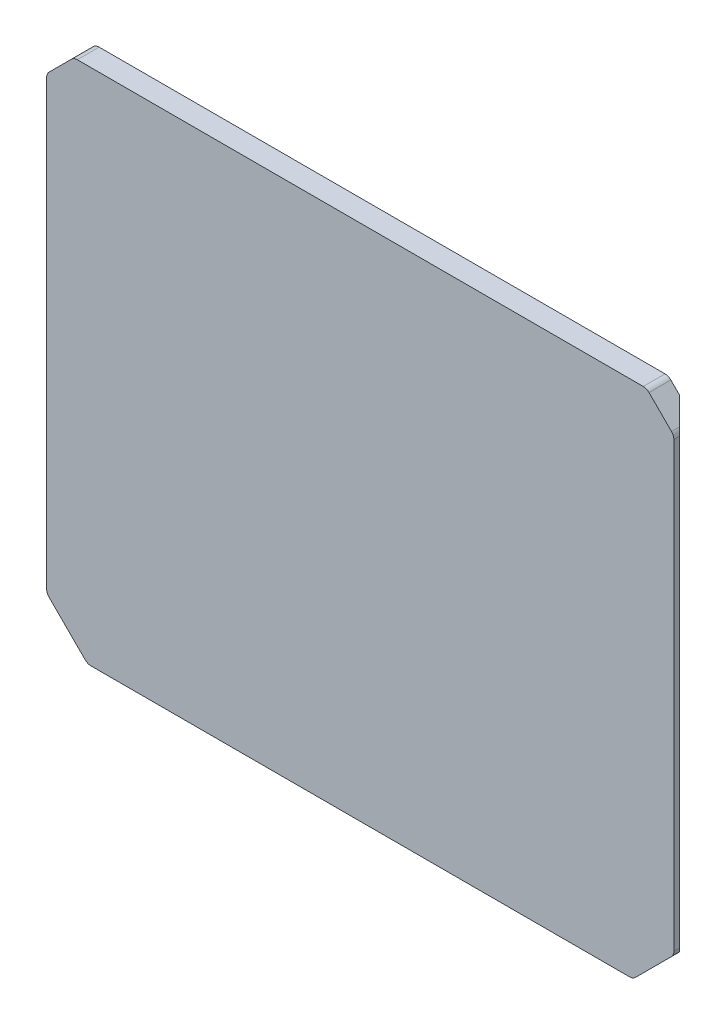
ISO-10303-21;
HEADER;
FILE_DESCRIPTION(('STEP AP214'),'2;1');
FILE_NAME('part.step','',(''),(''),'','','');
FILE_SCHEMA(('AUTOMOTIVE_DESIGN { 1 0 10303 214 1 1 1 1 }'));
ENDSEC;
DATA;
#1=APPLICATION_CONTEXT('core data for automotive mechanical design processes');
#2=APPLICATION_PROTOCOL_DEFINITION('international standard','automotive_design',2000,#1);
#3=PRODUCT_CONTEXT('',#1,'mechanical');
#4=PRODUCT('Part','Part','',(#3));
#5=PRODUCT_RELATED_PRODUCT_CATEGORY('part','',(#4));
#6=PRODUCT_DEFINITION_FORMATION('','',#4);
#7=PRODUCT_DEFINITION_CONTEXT('part definition',#1,'design');
#8=PRODUCT_DEFINITION('design','',#6,#7);
#9=PRODUCT_DEFINITION_SHAPE('','',#8);
#10=(LENGTH_UNIT() NAMED_UNIT(*) SI_UNIT(.MILLI.,.METRE.));
#11=(NAMED_UNIT(*) PLANE_ANGLE_UNIT() SI_UNIT($,.RADIAN.));
#12=(NAMED_UNIT(*) SI_UNIT($,.STERADIAN.) SOLID_ANGLE_UNIT());
#13=UNCERTAINTY_MEASURE_WITH_UNIT(LENGTH_MEASURE(1.E-05),#10,'distance_accuracy_value','');
#14=(GEOMETRIC_REPRESENTATION_CONTEXT(3) GLOBAL_UNCERTAINTY_ASSIGNED_CONTEXT((#13)) GLOBAL_UNIT_ASSIGNED_CONTEXT((#10,
#11,#12)) REPRESENTATION_CONTEXT('',''));
#15=CARTESIAN_POINT('',(0.,0.,0.));
#16=DIRECTION('',(0.,0.,1.));
#17=DIRECTION('',(1.,0.,0.));
#18=AXIS2_PLACEMENT_3D('',#15,#16,#17);
#19=CARTESIAN_POINT('',(-100.,0.,8.));
#20=DIRECTION('',(0.,1.,0.));
#21=DIRECTION('',(-1.,0.,0.));
#22=AXIS2_PLACEMENT_3D('',#19,#20,#21);
#23=PLANE('',#22);
#24=DIRECTION('',(1.,0.,0.));
#25=VECTOR('',#24,1.);
#26=CARTESIAN_POINT('',(-100.,0.,0.));
#27=LINE('',#26,#25);
#28=CARTESIAN_POINT('',(-98.7573593128807,0.,0.));
#29=VERTEX_POINT('',#28);
#30=CARTESIAN_POINT('',(98.7573593128807,0.,0.));
#31=VERTEX_POINT('',#30);
#32=EDGE_CURVE('E305',#29,#31,#27,.T.);
#33=ORIENTED_EDGE('',*,*,#32,.T.);
#34=DIRECTION('',(0.,0.,-1.));
#35=VECTOR('',#34,1.);
#36=CARTESIAN_POINT('',(98.7573593128807,0.,8.));
#37=LINE('',#36,#35);
#38=CARTESIAN_POINT('',(98.7573593128807,0.,8.));
#39=VERTEX_POINT('',#38);
#40=EDGE_CURVE('E264',#31,#39,#37,.F.);
#41=ORIENTED_EDGE('',*,*,#40,.T.);
#42=DIRECTION('',(1.,0.,0.));
#43=VECTOR('',#42,1.);
#44=CARTESIAN_POINT('',(-100.,0.,8.));
#45=LINE('',#44,#43);
#46=CARTESIAN_POINT('',(-98.7573593128807,0.,8.));
#47=VERTEX_POINT('',#46);
#48=EDGE_CURVE('E286',#47,#39,#45,.T.);
#49=ORIENTED_EDGE('',*,*,#48,.F.);
#50=DIRECTION('',(0.,0.,-1.));
#51=VECTOR('',#50,1.);
#52=CARTESIAN_POINT('',(-98.7573593128807,0.,8.));
#53=LINE('',#52,#51);
#54=EDGE_CURVE('E261',#47,#29,#53,.T.);
#55=ORIENTED_EDGE('',*,*,#54,.T.);
#56=EDGE_LOOP('',(#33,#41,#49,#55));
#57=FACE_BOUND('',#56,.T.);
#58=ADVANCED_FACE('F39',(#57),#23,.F.);
#59=CARTESIAN_POINT('',(100.,0.,8.));
#60=DIRECTION('',(-0.707106781186548,0.707106781186547,0.));
#61=DIRECTION('',(-0.707106781186547,-0.707106781186548,0.));
#62=AXIS2_PLACEMENT_3D('',#59,#60,#61);
#63=PLANE('',#62);
#64=DIRECTION('',(-0.577350269189626,-0.577350269189627,-0.577350269189624));
#65=VECTOR('',#64,1.);
#66=CARTESIAN_POINT('',(115.,15.,6.));
#67=LINE('',#66,#65);
#68=CARTESIAN_POINT('',(109.,8.99999999999998,0.));
#69=VERTEX_POINT('',#68);
#70=CARTESIAN_POINT('',(114.12132034356,14.1213203435596,5.12132034355965));
#71=VERTEX_POINT('',#70);
#72=EDGE_CURVE('E191',#69,#71,#67,.F.);
#73=ORIENTED_EDGE('',*,*,#72,.T.);
#74=DIRECTION('',(0.,0.,-1.));
#75=VECTOR('',#74,1.);
#76=CARTESIAN_POINT('',(114.12132034356,14.1213203435596,8.));
#77=LINE('',#76,#75);
#78=CARTESIAN_POINT('',(114.12132034356,14.1213203435596,8.));
#79=VERTEX_POINT('',#78);
#80=EDGE_CURVE('E259',#71,#79,#77,.F.);
#81=ORIENTED_EDGE('',*,*,#80,.T.);
#82=DIRECTION('',(0.707106781186547,0.707106781186548,0.));
#83=VECTOR('',#82,1.);
#84=CARTESIAN_POINT('',(100.,0.,8.));
#85=LINE('',#84,#83);
#86=CARTESIAN_POINT('',(100.87867965644,0.878679656440342,8.));
#87=VERTEX_POINT('',#86);
#88=EDGE_CURVE('E289',#87,#79,#85,.T.);
#89=ORIENTED_EDGE('',*,*,#88,.F.);
#90=DIRECTION('',(0.,0.,-1.));
#91=VECTOR('',#90,1.);
#92=CARTESIAN_POINT('',(100.87867965644,0.878679656440342,8.));
#93=LINE('',#92,#91);
#94=CARTESIAN_POINT('',(100.87867965644,0.878679656440342,0.));
#95=VERTEX_POINT('',#94);
#96=EDGE_CURVE('E256',#87,#95,#93,.T.);
#97=ORIENTED_EDGE('',*,*,#96,.T.);
#98=DIRECTION('',(0.707106781186547,0.707106781186548,0.));
#99=VECTOR('',#98,1.);
#100=CARTESIAN_POINT('',(100.,0.,0.));
#101=LINE('',#100,#99);
#102=EDGE_CURVE('E187',#95,#69,#101,.T.);
#103=ORIENTED_EDGE('',*,*,#102,.T.);
#104=EDGE_LOOP('',(#73,#81,#89,#97,#103));
#105=FACE_BOUND('',#104,.T.);
#106=ADVANCED_FACE('F344',(#105),#63,.F.);
#107=CARTESIAN_POINT('',(115.,15.,8.));
#108=DIRECTION('',(-1.,0.,0.));
#109=DIRECTION('',(0.,-1.,0.));
#110=AXIS2_PLACEMENT_3D('',#107,#108,#109);
#111=PLANE('',#110);
#112=DIRECTION('',(0.,1.,0.));
#113=VECTOR('',#112,1.);
#114=CARTESIAN_POINT('',(115.,15.,6.));
#115=LINE('',#114,#113);
#116=CARTESIAN_POINT('',(115.,16.2426406871193,6.));
#117=VERTEX_POINT('',#116);
#118=CARTESIAN_POINT('',(115.,178.757359312881,6.));
#119=VERTEX_POINT('',#118);
#120=EDGE_CURVE('E175',#117,#119,#115,.T.);
#121=ORIENTED_EDGE('',*,*,#120,.T.);
#122=DIRECTION('',(0.,0.,-1.));
#123=VECTOR('',#122,1.);
#124=CARTESIAN_POINT('',(115.,178.757359312881,8.));
#125=LINE('',#124,#123);
#126=CARTESIAN_POINT('',(115.,178.757359312881,8.));
#127=VERTEX_POINT('',#126);
#128=EDGE_CURVE('E254',#119,#127,#125,.F.);
#129=ORIENTED_EDGE('',*,*,#128,.T.);
#130=DIRECTION('',(0.,1.,0.));
#131=VECTOR('',#130,1.);
#132=CARTESIAN_POINT('',(115.,15.,8.));
#133=LINE('',#132,#131);
#134=CARTESIAN_POINT('',(115.,16.2426406871193,8.));
#135=VERTEX_POINT('',#134);
#136=EDGE_CURVE('E332',#135,#127,#133,.T.);
#137=ORIENTED_EDGE('',*,*,#136,.F.);
#138=DIRECTION('',(0.,0.,-1.));
#139=VECTOR('',#138,1.);
#140=CARTESIAN_POINT('',(115.,16.2426406871193,8.));
#141=LINE('',#140,#139);
#142=EDGE_CURVE('E252',#135,#117,#141,.T.);
#143=ORIENTED_EDGE('',*,*,#142,.T.);
#144=EDGE_LOOP('',(#121,#129,#137,#143));
#145=FACE_BOUND('',#144,.T.);
#146=ADVANCED_FACE('F343',(#145),#111,.F.);
#147=CARTESIAN_POINT('',(105.,190.,8.));
#148=DIRECTION('',(-0.707106781186547,-0.707106781186547,0.));
#149=DIRECTION('',(0.707106781186548,-0.707106781186548,0.));
#150=AXIS2_PLACEMENT_3D('',#147,#148,#149);
#151=PLANE('',#150);
#152=DIRECTION('',(-0.707106781186547,0.707106781186547,0.));
#153=VECTOR('',#152,1.);
#154=CARTESIAN_POINT('',(105.,190.,8.));
#155=LINE('',#154,#153);
#156=CARTESIAN_POINT('',(114.12132034356,180.87867965644,8.));
#157=VERTEX_POINT('',#156);
#158=CARTESIAN_POINT('',(105.87867965644,189.12132034356,8.));
#159=VERTEX_POINT('',#158);
#160=EDGE_CURVE('E327',#157,#159,#155,.T.);
#161=ORIENTED_EDGE('',*,*,#160,.F.);
#162=DIRECTION('',(0.,0.,-1.));
#163=VECTOR('',#162,1.);
#164=CARTESIAN_POINT('',(114.12132034356,180.87867965644,8.));
#165=LINE('',#164,#163);
#166=CARTESIAN_POINT('',(114.12132034356,180.87867965644,5.1213203435596));
#167=VERTEX_POINT('',#166);
#168=EDGE_CURVE('E172',#157,#167,#165,.T.);
#169=ORIENTED_EDGE('',*,*,#168,.T.);
#170=DIRECTION('',(0.577350269189626,-0.577350269189626,0.577350269189625));
#171=VECTOR('',#170,1.);
#172=CARTESIAN_POINT('',(170.,125.,60.9999999999999));
#173=LINE('',#172,#171);
#174=CARTESIAN_POINT('',(109.,186.,0.));
#175=VERTEX_POINT('',#174);
#176=EDGE_CURVE('E165',#167,#175,#173,.F.);
#177=ORIENTED_EDGE('',*,*,#176,.T.);
#178=DIRECTION('',(-0.707106781186547,0.707106781186547,0.));
#179=VECTOR('',#178,1.);
#180=CARTESIAN_POINT('',(105.,190.,0.));
#181=LINE('',#180,#179);
#182=CARTESIAN_POINT('',(105.87867965644,189.12132034356,0.));
#183=VERTEX_POINT('',#182);
#184=EDGE_CURVE('E169',#175,#183,#181,.T.);
#185=ORIENTED_EDGE('',*,*,#184,.T.);
#186=DIRECTION('',(0.,0.,-1.));
#187=VECTOR('',#186,1.);
#188=CARTESIAN_POINT('',(105.87867965644,189.12132034356,8.));
#189=LINE('',#188,#187);
#190=EDGE_CURVE('E247',#183,#159,#189,.F.);
#191=ORIENTED_EDGE('',*,*,#190,.T.);
#192=EDGE_LOOP('',(#161,#169,#177,#185,#191));
#193=FACE_BOUND('',#192,.T.);
#194=ADVANCED_FACE('F168',(#193),#151,.F.);
#195=CARTESIAN_POINT('',(-105.,190.,8.));
#196=DIRECTION('',(0.,-1.,0.));
#197=DIRECTION('',(0.,0.,-1.));
#198=AXIS2_PLACEMENT_3D('',#195,#196,#197);
#199=PLANE('',#198);
#200=DIRECTION('',(-1.,0.,0.));
#201=VECTOR('',#200,1.);
#202=CARTESIAN_POINT('',(-105.,190.,0.));
#203=LINE('',#202,#201);
#204=CARTESIAN_POINT('',(103.757359312881,190.,0.));
#205=VERTEX_POINT('',#204);
#206=CARTESIAN_POINT('',(-103.757359312881,190.,0.));
#207=VERTEX_POINT('',#206);
#208=EDGE_CURVE('E186',#205,#207,#203,.T.);
#209=ORIENTED_EDGE('',*,*,#208,.T.);
#210=DIRECTION('',(0.,0.,-1.));
#211=VECTOR('',#210,1.);
#212=CARTESIAN_POINT('',(-103.757359312881,190.,8.));
#213=LINE('',#212,#211);
#214=CARTESIAN_POINT('',(-103.757359312881,190.,8.));
#215=VERTEX_POINT('',#214);
#216=EDGE_CURVE('E220',#207,#215,#213,.F.);
#217=ORIENTED_EDGE('',*,*,#216,.T.);
#218=DIRECTION('',(-1.,0.,0.));
#219=VECTOR('',#218,1.);
#220=CARTESIAN_POINT('',(-105.,190.,8.));
#221=LINE('',#220,#219);
#222=CARTESIAN_POINT('',(103.757359312881,190.,8.));
#223=VERTEX_POINT('',#222);
#224=EDGE_CURVE('E323',#223,#215,#221,.T.);
#225=ORIENTED_EDGE('',*,*,#224,.F.);
#226=DIRECTION('',(0.,0.,-1.));
#227=VECTOR('',#226,1.);
#228=CARTESIAN_POINT('',(103.757359312881,190.,8.));
#229=LINE('',#228,#227);
#230=EDGE_CURVE('E217',#223,#205,#229,.T.);
#231=ORIENTED_EDGE('',*,*,#230,.T.);
#232=EDGE_LOOP('',(#209,#217,#225,#231));
#233=FACE_BOUND('',#232,.T.);
#234=ADVANCED_FACE('F311',(#233),#199,.F.);
#235=CARTESIAN_POINT('',(-115.,180.,8.));
#236=DIRECTION('',(0.707106781186549,-0.707106781186546,0.));
#237=DIRECTION('',(0.707106781186546,0.707106781186549,0.));
#238=AXIS2_PLACEMENT_3D('',#235,#236,#237);
#239=PLANE('',#238);
#240=DIRECTION('',(-0.707106781186546,-0.707106781186549,0.));
#241=VECTOR('',#240,1.);
#242=CARTESIAN_POINT('',(-115.,180.,8.));
#243=LINE('',#242,#241);
#244=CARTESIAN_POINT('',(-105.87867965644,189.12132034356,8.));
#245=VERTEX_POINT('',#244);
#246=CARTESIAN_POINT('',(-114.12132034356,180.87867965644,8.));
#247=VERTEX_POINT('',#246);
#248=EDGE_CURVE('E301',#245,#247,#243,.T.);
#249=ORIENTED_EDGE('',*,*,#248,.F.);
#250=DIRECTION('',(0.,0.,-1.));
#251=VECTOR('',#250,1.);
#252=CARTESIAN_POINT('',(-105.87867965644,189.12132034356,8.));
#253=LINE('',#252,#251);
#254=CARTESIAN_POINT('',(-105.87867965644,189.12132034356,0.));
#255=VERTEX_POINT('',#254);
#256=EDGE_CURVE('E207',#245,#255,#253,.T.);
#257=ORIENTED_EDGE('',*,*,#256,.T.);
#258=DIRECTION('',(-0.707106781186546,-0.707106781186549,0.));
#259=VECTOR('',#258,1.);
#260=CARTESIAN_POINT('',(-115.,180.,0.));
#261=LINE('',#260,#259);
#262=CARTESIAN_POINT('',(-109.,186.,0.));
#263=VERTEX_POINT('',#262);
#264=EDGE_CURVE('E282',#255,#263,#261,.T.);
#265=ORIENTED_EDGE('',*,*,#264,.T.);
#266=DIRECTION('',(0.577350269189626,0.577350269189629,-0.577350269189623));
#267=VECTOR('',#266,1.);
#268=CARTESIAN_POINT('',(-170.,124.999999999999,61.));
#269=LINE('',#268,#267);
#270=CARTESIAN_POINT('',(-114.12132034356,180.87867965644,5.12132034355962));
#271=VERTEX_POINT('',#270);
#272=EDGE_CURVE('E202',#263,#271,#269,.F.);
#273=ORIENTED_EDGE('',*,*,#272,.T.);
#274=DIRECTION('',(0.,0.,-1.));
#275=VECTOR('',#274,1.);
#276=CARTESIAN_POINT('',(-114.12132034356,180.87867965644,8.));
#277=LINE('',#276,#275);
#278=EDGE_CURVE('E205',#271,#247,#277,.F.);
#279=ORIENTED_EDGE('',*,*,#278,.T.);
#280=EDGE_LOOP('',(#249,#257,#265,#273,#279));
#281=FACE_BOUND('',#280,.T.);
#282=ADVANCED_FACE('F325',(#281),#239,.F.);
#283=CARTESIAN_POINT('',(-115.,15.,8.));
#284=DIRECTION('',(1.,0.,0.));
#285=DIRECTION('',(0.,1.,0.));
#286=AXIS2_PLACEMENT_3D('',#283,#284,#285);
#287=PLANE('',#286);
#288=DIRECTION('',(0.,-1.,0.));
#289=VECTOR('',#288,1.);
#290=CARTESIAN_POINT('',(-115.,15.,8.));
#291=LINE('',#290,#289);
#292=CARTESIAN_POINT('',(-115.,178.757359312881,8.));
#293=VERTEX_POINT('',#292);
#294=CARTESIAN_POINT('',(-115.,16.2426406871193,8.));
#295=VERTEX_POINT('',#294);
#296=EDGE_CURVE('E296',#293,#295,#291,.T.);
#297=ORIENTED_EDGE('',*,*,#296,.F.);
#298=DIRECTION('',(0.,0.,-1.));
#299=VECTOR('',#298,1.);
#300=CARTESIAN_POINT('',(-115.,178.757359312881,8.));
#301=LINE('',#300,#299);
#302=CARTESIAN_POINT('',(-115.,178.757359312881,6.));
#303=VERTEX_POINT('',#302);
#304=EDGE_CURVE('E240',#293,#303,#301,.T.);
#305=ORIENTED_EDGE('',*,*,#304,.T.);
#306=DIRECTION('',(0.,-1.,0.));
#307=VECTOR('',#306,1.);
#308=CARTESIAN_POINT('',(-115.,15.,6.));
#309=LINE('',#308,#307);
#310=CARTESIAN_POINT('',(-115.,16.2426406871193,6.));
#311=VERTEX_POINT('',#310);
#312=EDGE_CURVE('E193',#303,#311,#309,.T.);
#313=ORIENTED_EDGE('',*,*,#312,.T.);
#314=DIRECTION('',(0.,0.,-1.));
#315=VECTOR('',#314,1.);
#316=CARTESIAN_POINT('',(-115.,16.2426406871193,8.));
#317=LINE('',#316,#315);
#318=EDGE_CURVE('E238',#311,#295,#317,.F.);
#319=ORIENTED_EDGE('',*,*,#318,.T.);
#320=EDGE_LOOP('',(#297,#305,#313,#319));
#321=FACE_BOUND('',#320,.T.);
#322=ADVANCED_FACE('F412',(#321),#287,.F.);
#323=CARTESIAN_POINT('',(-115.,15.,8.));
#324=DIRECTION('',(0.707106781186547,0.707106781186547,0.));
#325=DIRECTION('',(-0.707106781186548,0.707106781186548,0.));
#326=AXIS2_PLACEMENT_3D('',#323,#324,#325);
#327=PLANE('',#326);
#328=DIRECTION('',(0.707106781186547,-0.707106781186547,0.));
#329=VECTOR('',#328,1.);
#330=CARTESIAN_POINT('',(-115.,15.,0.));
#331=LINE('',#330,#329);
#332=CARTESIAN_POINT('',(-109.,8.99999999999997,0.));
#333=VERTEX_POINT('',#332);
#334=CARTESIAN_POINT('',(-100.87867965644,0.878679656440357,0.));
#335=VERTEX_POINT('',#334);
#336=EDGE_CURVE('E283',#333,#335,#331,.T.);
#337=ORIENTED_EDGE('',*,*,#336,.T.);
#338=DIRECTION('',(0.,0.,-1.));
#339=VECTOR('',#338,1.);
#340=CARTESIAN_POINT('',(-100.87867965644,0.878679656440354,8.));
#341=LINE('',#340,#339);
#342=CARTESIAN_POINT('',(-100.87867965644,0.878679656440357,8.));
#343=VERTEX_POINT('',#342);
#344=EDGE_CURVE('E11',#335,#343,#341,.F.);
#345=ORIENTED_EDGE('',*,*,#344,.T.);
#346=DIRECTION('',(0.707106781186547,-0.707106781186547,0.));
#347=VECTOR('',#346,1.);
#348=CARTESIAN_POINT('',(-115.,15.,8.));
#349=LINE('',#348,#347);
#350=CARTESIAN_POINT('',(-114.12132034356,14.1213203435596,8.));
#351=VERTEX_POINT('',#350);
#352=EDGE_CURVE('E274',#351,#343,#349,.T.);
#353=ORIENTED_EDGE('',*,*,#352,.F.);
#354=DIRECTION('',(0.,0.,-1.));
#355=VECTOR('',#354,1.);
#356=CARTESIAN_POINT('',(-114.12132034356,14.1213203435596,8.));
#357=LINE('',#356,#355);
#358=CARTESIAN_POINT('',(-114.12132034356,14.1213203435596,5.12132034355965));
#359=VERTEX_POINT('',#358);
#360=EDGE_CURVE('E47',#351,#359,#357,.T.);
#361=ORIENTED_EDGE('',*,*,#360,.T.);
#362=DIRECTION('',(-0.577350269189627,0.577350269189627,0.577350269189624));
#363=VECTOR('',#362,1.);
#364=CARTESIAN_POINT('',(-115.,15.,6.));
#365=LINE('',#364,#363);
#366=EDGE_CURVE('E200',#359,#333,#365,.F.);
#367=ORIENTED_EDGE('',*,*,#366,.T.);
#368=EDGE_LOOP('',(#337,#345,#353,#361,#367));
#369=FACE_BOUND('',#368,.T.);
#370=ADVANCED_FACE('F271',(#369),#327,.F.);
#371=CARTESIAN_POINT('',(115.,0.,8.));
#372=DIRECTION('',(0.,0.,1.));
#373=DIRECTION('',(1.,0.,0.));
#374=AXIS2_PLACEMENT_3D('',#371,#372,#373);
#375=PLANE('',#374);
#376=ORIENTED_EDGE('',*,*,#224,.T.);
#377=CARTESIAN_POINT('',(-103.757359312881,187.,8.));
#378=DIRECTION('',(0.,0.,1.));
#379=DIRECTION('',(1.,0.,0.));
#380=AXIS2_PLACEMENT_3D('',#377,#378,#379);
#381=CIRCLE('',#380,3.);
#382=EDGE_CURVE('E236',#215,#245,#381,.T.);
#383=ORIENTED_EDGE('',*,*,#382,.T.);
#384=ORIENTED_EDGE('',*,*,#248,.T.);
#385=CARTESIAN_POINT('',(-112.,178.757359312881,8.));
#386=DIRECTION('',(0.,0.,1.));
#387=DIRECTION('',(1.,0.,0.));
#388=AXIS2_PLACEMENT_3D('',#385,#386,#387);
#389=CIRCLE('',#388,3.);
#390=EDGE_CURVE('E234',#247,#293,#389,.T.);
#391=ORIENTED_EDGE('',*,*,#390,.T.);
#392=ORIENTED_EDGE('',*,*,#296,.T.);
#393=CARTESIAN_POINT('',(-112.,16.2426406871193,8.));
#394=DIRECTION('',(0.,0.,1.));
#395=DIRECTION('',(1.,0.,0.));
#396=AXIS2_PLACEMENT_3D('',#393,#394,#395);
#397=CIRCLE('',#396,3.);
#398=EDGE_CURVE('E222',#295,#351,#397,.T.);
#399=ORIENTED_EDGE('',*,*,#398,.T.);
#400=ORIENTED_EDGE('',*,*,#352,.T.);
#401=CARTESIAN_POINT('',(-98.7573593128807,3.,8.));
#402=DIRECTION('',(0.,0.,1.));
#403=DIRECTION('',(1.,0.,0.));
#404=AXIS2_PLACEMENT_3D('',#401,#402,#403);
#405=CIRCLE('',#404,3.);
#406=EDGE_CURVE('E224',#343,#47,#405,.T.);
#407=ORIENTED_EDGE('',*,*,#406,.T.);
#408=ORIENTED_EDGE('',*,*,#48,.T.);
#409=CARTESIAN_POINT('',(98.7573593128807,2.99999999999999,8.));
#410=DIRECTION('',(0.,0.,1.));
#411=DIRECTION('',(1.,0.,0.));
#412=AXIS2_PLACEMENT_3D('',#409,#410,#411);
#413=CIRCLE('',#412,3.);
#414=EDGE_CURVE('E226',#39,#87,#413,.T.);
#415=ORIENTED_EDGE('',*,*,#414,.T.);
#416=ORIENTED_EDGE('',*,*,#88,.T.);
#417=CARTESIAN_POINT('',(112.,16.2426406871193,8.));
#418=DIRECTION('',(0.,0.,1.));
#419=DIRECTION('',(1.,0.,0.));
#420=AXIS2_PLACEMENT_3D('',#417,#418,#419);
#421=CIRCLE('',#420,3.);
#422=EDGE_CURVE('E228',#79,#135,#421,.T.);
#423=ORIENTED_EDGE('',*,*,#422,.T.);
#424=ORIENTED_EDGE('',*,*,#136,.T.);
#425=CARTESIAN_POINT('',(112.,178.757359312881,8.));
#426=DIRECTION('',(0.,0.,1.));
#427=DIRECTION('',(1.,0.,0.));
#428=AXIS2_PLACEMENT_3D('',#425,#426,#427);
#429=CIRCLE('',#428,3.);
#430=EDGE_CURVE('E232',#127,#157,#429,.T.);
#431=ORIENTED_EDGE('',*,*,#430,.T.);
#432=ORIENTED_EDGE('',*,*,#160,.T.);
#433=CARTESIAN_POINT('',(103.757359312881,187.,8.));
#434=DIRECTION('',(0.,0.,1.));
#435=DIRECTION('',(1.,0.,0.));
#436=AXIS2_PLACEMENT_3D('',#433,#434,#435);
#437=CIRCLE('',#436,3.);
#438=EDGE_CURVE('E230',#159,#223,#437,.T.);
#439=ORIENTED_EDGE('',*,*,#438,.T.);
#440=EDGE_LOOP('',(#376,#383,#384,#391,#392,#399,#400,#407,#408,#415,#416,#423,#424,#431,#432,#439));
#441=FACE_BOUND('',#440,.T.);
#442=ADVANCED_FACE('F321',(#441),#375,.T.);
#443=CARTESIAN_POINT('',(115.,0.,0.));
#444=DIRECTION('',(0.,0.,1.));
#445=DIRECTION('',(1.,0.,0.));
#446=AXIS2_PLACEMENT_3D('',#443,#444,#445);
#447=PLANE('',#446);
#448=ORIENTED_EDGE('',*,*,#264,.F.);
#449=CARTESIAN_POINT('',(-103.757359312881,187.,0.));
#450=DIRECTION('',(0.,0.,1.));
#451=DIRECTION('',(1.,0.,0.));
#452=AXIS2_PLACEMENT_3D('',#449,#450,#451);
#453=CIRCLE('',#452,3.);
#454=EDGE_CURVE('E215',#255,#207,#453,.F.);
#455=ORIENTED_EDGE('',*,*,#454,.T.);
#456=ORIENTED_EDGE('',*,*,#208,.F.);
#457=CARTESIAN_POINT('',(103.757359312881,187.,0.));
#458=DIRECTION('',(0.,0.,1.));
#459=DIRECTION('',(1.,0.,0.));
#460=AXIS2_PLACEMENT_3D('',#457,#458,#459);
#461=CIRCLE('',#460,3.);
#462=EDGE_CURVE('E185',#205,#183,#461,.F.);
#463=ORIENTED_EDGE('',*,*,#462,.T.);
#464=ORIENTED_EDGE('',*,*,#184,.F.);
#465=DIRECTION('',(0.,-1.,0.));
#466=VECTOR('',#465,1.);
#467=CARTESIAN_POINT('',(109.,0.,0.));
#468=LINE('',#467,#466);
#469=EDGE_CURVE('E182',#175,#69,#468,.T.);
#470=ORIENTED_EDGE('',*,*,#469,.T.);
#471=ORIENTED_EDGE('',*,*,#102,.F.);
#472=CARTESIAN_POINT('',(98.7573593128807,2.99999999999999,0.));
#473=DIRECTION('',(0.,0.,1.));
#474=DIRECTION('',(1.,0.,0.));
#475=AXIS2_PLACEMENT_3D('',#472,#473,#474);
#476=CIRCLE('',#475,3.);
#477=EDGE_CURVE('E212',#95,#31,#476,.F.);
#478=ORIENTED_EDGE('',*,*,#477,.T.);
#479=ORIENTED_EDGE('',*,*,#32,.F.);
#480=CARTESIAN_POINT('',(-98.7573593128807,3.,0.));
#481=DIRECTION('',(0.,0.,1.));
#482=DIRECTION('',(1.,0.,0.));
#483=AXIS2_PLACEMENT_3D('',#480,#481,#482);
#484=CIRCLE('',#483,3.);
#485=EDGE_CURVE('E210',#29,#335,#484,.F.);
#486=ORIENTED_EDGE('',*,*,#485,.T.);
#487=ORIENTED_EDGE('',*,*,#336,.F.);
#488=DIRECTION('',(0.,1.,0.));
#489=VECTOR('',#488,1.);
#490=CARTESIAN_POINT('',(-109.,0.,0.));
#491=LINE('',#490,#489);
#492=EDGE_CURVE('E174',#333,#263,#491,.T.);
#493=ORIENTED_EDGE('',*,*,#492,.T.);
#494=EDGE_LOOP('',(#448,#455,#456,#463,#464,#470,#471,#478,#479,#486,#487,#493));
#495=FACE_BOUND('',#494,.T.);
#496=ADVANCED_FACE('F180',(#495),#447,.F.);
#497=CARTESIAN_POINT('',(115.,15.,6.));
#498=DIRECTION('',(-0.707106781186546,0.,0.707106781186549));
#499=DIRECTION('',(0.707106781186549,0.,0.707106781186546));
#500=AXIS2_PLACEMENT_3D('',#497,#498,#499);
#501=PLANE('',#500);
#502=ORIENTED_EDGE('',*,*,#176,.F.);
#503=CARTESIAN_POINT('',(112.,178.757359312881,3.00000000000001));
#504=DIRECTION('',(-0.707106781186546,0.,0.707106781186549));
#505=DIRECTION('',(-0.707106781186549,0.,-0.707106781186546));
#506=AXIS2_PLACEMENT_3D('',#503,#504,#505);
#507=ELLIPSE('',#506,4.24264068711928,3.);
#508=EDGE_CURVE('E54',#167,#119,#507,.F.);
#509=ORIENTED_EDGE('',*,*,#508,.T.);
#510=ORIENTED_EDGE('',*,*,#120,.F.);
#511=CARTESIAN_POINT('',(112.,16.2426406871193,3.00000000000001));
#512=DIRECTION('',(-0.707106781186546,0.,0.707106781186549));
#513=DIRECTION('',(-0.707106781186549,0.,-0.707106781186546));
#514=AXIS2_PLACEMENT_3D('',#511,#512,#513);
#515=ELLIPSE('',#514,4.24264068711928,3.);
#516=EDGE_CURVE('E62',#117,#71,#515,.F.);
#517=ORIENTED_EDGE('',*,*,#516,.T.);
#518=ORIENTED_EDGE('',*,*,#72,.F.);
#519=ORIENTED_EDGE('',*,*,#469,.F.);
#520=EDGE_LOOP('',(#502,#509,#510,#517,#518,#519));
#521=FACE_BOUND('',#520,.T.);
#522=ADVANCED_FACE('F189',(#521),#501,.F.);
#523=CARTESIAN_POINT('',(-115.,15.,6.));
#524=DIRECTION('',(0.707106781186545,0.,0.70710678118655));
#525=DIRECTION('',(0.70710678118655,0.,-0.707106781186545));
#526=AXIS2_PLACEMENT_3D('',#523,#524,#525);
#527=PLANE('',#526);
#528=ORIENTED_EDGE('',*,*,#312,.F.);
#529=CARTESIAN_POINT('',(-112.,178.757359312881,3.00000000000001));
#530=DIRECTION('',(0.707106781186545,0.,0.70710678118655));
#531=DIRECTION('',(0.70710678118655,0.,-0.707106781186545));
#532=AXIS2_PLACEMENT_3D('',#529,#530,#531);
#533=ELLIPSE('',#532,4.24264068711927,3.);
#534=EDGE_CURVE('E245',#303,#271,#533,.F.);
#535=ORIENTED_EDGE('',*,*,#534,.T.);
#536=ORIENTED_EDGE('',*,*,#272,.F.);
#537=ORIENTED_EDGE('',*,*,#492,.F.);
#538=ORIENTED_EDGE('',*,*,#366,.F.);
#539=CARTESIAN_POINT('',(-112.,16.2426406871193,3.00000000000001));
#540=DIRECTION('',(0.707106781186545,0.,0.70710678118655));
#541=DIRECTION('',(0.70710678118655,0.,-0.707106781186545));
#542=AXIS2_PLACEMENT_3D('',#539,#540,#541);
#543=ELLIPSE('',#542,4.24264068711927,3.);
#544=EDGE_CURVE('E243',#359,#311,#543,.F.);
#545=ORIENTED_EDGE('',*,*,#544,.T.);
#546=EDGE_LOOP('',(#528,#535,#536,#537,#538,#545));
#547=FACE_BOUND('',#546,.T.);
#548=ADVANCED_FACE('F280',(#547),#527,.F.);
#549=CARTESIAN_POINT('',(-103.757359312881,187.,8.));
#550=DIRECTION('',(0.,0.,-1.));
#551=DIRECTION('',(-1.,0.,0.));
#552=AXIS2_PLACEMENT_3D('',#549,#550,#551);
#553=CYLINDRICAL_SURFACE('',#552,3.);
#554=ORIENTED_EDGE('',*,*,#382,.F.);
#555=ORIENTED_EDGE('',*,*,#216,.F.);
#556=ORIENTED_EDGE('',*,*,#454,.F.);
#557=ORIENTED_EDGE('',*,*,#256,.F.);
#558=EDGE_LOOP('',(#554,#555,#556,#557));
#559=FACE_BOUND('',#558,.T.);
#560=ADVANCED_FACE('F317',(#559),#553,.T.);
#561=CARTESIAN_POINT('',(-112.,178.757359312881,8.));
#562=DIRECTION('',(0.,0.,-1.));
#563=DIRECTION('',(-1.,0.,0.));
#564=AXIS2_PLACEMENT_3D('',#561,#562,#563);
#565=CYLINDRICAL_SURFACE('',#564,3.);
#566=ORIENTED_EDGE('',*,*,#390,.F.);
#567=ORIENTED_EDGE('',*,*,#278,.F.);
#568=ORIENTED_EDGE('',*,*,#534,.F.);
#569=ORIENTED_EDGE('',*,*,#304,.F.);
#570=EDGE_LOOP('',(#566,#567,#568,#569));
#571=FACE_BOUND('',#570,.T.);
#572=ADVANCED_FACE('F375',(#571),#565,.T.);
#573=CARTESIAN_POINT('',(112.,178.757359312881,8.));
#574=DIRECTION('',(0.,0.,-1.));
#575=DIRECTION('',(-1.,0.,0.));
#576=AXIS2_PLACEMENT_3D('',#573,#574,#575);
#577=CYLINDRICAL_SURFACE('',#576,3.);
#578=ORIENTED_EDGE('',*,*,#430,.F.);
#579=ORIENTED_EDGE('',*,*,#128,.F.);
#580=ORIENTED_EDGE('',*,*,#508,.F.);
#581=ORIENTED_EDGE('',*,*,#168,.F.);
#582=EDGE_LOOP('',(#578,#579,#580,#581));
#583=FACE_BOUND('',#582,.T.);
#584=ADVANCED_FACE('F378',(#583),#577,.T.);
#585=CARTESIAN_POINT('',(103.757359312881,187.,8.));
#586=DIRECTION('',(0.,0.,-1.));
#587=DIRECTION('',(-1.,0.,0.));
#588=AXIS2_PLACEMENT_3D('',#585,#586,#587);
#589=CYLINDRICAL_SURFACE('',#588,3.);
#590=ORIENTED_EDGE('',*,*,#438,.F.);
#591=ORIENTED_EDGE('',*,*,#190,.F.);
#592=ORIENTED_EDGE('',*,*,#462,.F.);
#593=ORIENTED_EDGE('',*,*,#230,.F.);
#594=EDGE_LOOP('',(#590,#591,#592,#593));
#595=FACE_BOUND('',#594,.T.);
#596=ADVANCED_FACE('F359',(#595),#589,.T.);
#597=CARTESIAN_POINT('',(112.,16.2426406871193,8.));
#598=DIRECTION('',(0.,0.,-1.));
#599=DIRECTION('',(-1.,0.,0.));
#600=AXIS2_PLACEMENT_3D('',#597,#598,#599);
#601=CYLINDRICAL_SURFACE('',#600,3.);
#602=ORIENTED_EDGE('',*,*,#422,.F.);
#603=ORIENTED_EDGE('',*,*,#80,.F.);
#604=ORIENTED_EDGE('',*,*,#516,.F.);
#605=ORIENTED_EDGE('',*,*,#142,.F.);
#606=EDGE_LOOP('',(#602,#603,#604,#605));
#607=FACE_BOUND('',#606,.T.);
#608=ADVANCED_FACE('F342',(#607),#601,.T.);
#609=CARTESIAN_POINT('',(98.7573593128807,2.99999999999999,8.));
#610=DIRECTION('',(0.,0.,-1.));
#611=DIRECTION('',(-1.,0.,0.));
#612=AXIS2_PLACEMENT_3D('',#609,#610,#611);
#613=CYLINDRICAL_SURFACE('',#612,3.);
#614=ORIENTED_EDGE('',*,*,#414,.F.);
#615=ORIENTED_EDGE('',*,*,#40,.F.);
#616=ORIENTED_EDGE('',*,*,#477,.F.);
#617=ORIENTED_EDGE('',*,*,#96,.F.);
#618=EDGE_LOOP('',(#614,#615,#616,#617));
#619=FACE_BOUND('',#618,.T.);
#620=ADVANCED_FACE('F350',(#619),#613,.T.);
#621=CARTESIAN_POINT('',(-98.7573593128807,3.,8.));
#622=DIRECTION('',(0.,0.,-1.));
#623=DIRECTION('',(-1.,0.,0.));
#624=AXIS2_PLACEMENT_3D('',#621,#622,#623);
#625=CYLINDRICAL_SURFACE('',#624,3.);
#626=ORIENTED_EDGE('',*,*,#406,.F.);
#627=ORIENTED_EDGE('',*,*,#344,.F.);
#628=ORIENTED_EDGE('',*,*,#485,.F.);
#629=ORIENTED_EDGE('',*,*,#54,.F.);
#630=EDGE_LOOP('',(#626,#627,#628,#629));
#631=FACE_BOUND('',#630,.T.);
#632=ADVANCED_FACE('F352',(#631),#625,.T.);
#633=CARTESIAN_POINT('',(-112.,16.2426406871193,8.));
#634=DIRECTION('',(0.,0.,-1.));
#635=DIRECTION('',(-1.,0.,0.));
#636=AXIS2_PLACEMENT_3D('',#633,#634,#635);
#637=CYLINDRICAL_SURFACE('',#636,3.);
#638=ORIENTED_EDGE('',*,*,#398,.F.);
#639=ORIENTED_EDGE('',*,*,#318,.F.);
#640=ORIENTED_EDGE('',*,*,#544,.F.);
#641=ORIENTED_EDGE('',*,*,#360,.F.);
#642=EDGE_LOOP('',(#638,#639,#640,#641));
#643=FACE_BOUND('',#642,.T.);
#644=ADVANCED_FACE('F41',(#643),#637,.T.);
#645=CLOSED_SHELL('',(#58,#106,#146,#194,#234,#282,#322,#370,#442,#496,#522,#548,#560,#572,#584,
#596,#608,#620,#632,#644));
#646=MANIFOLD_SOLID_BREP('B2',#645);
#647=ADVANCED_BREP_SHAPE_REPRESENTATION('',(#18,#646),#14);
#648=SHAPE_DEFINITION_REPRESENTATION(#9,#647);
ENDSEC;
END-ISO-10303-21;
